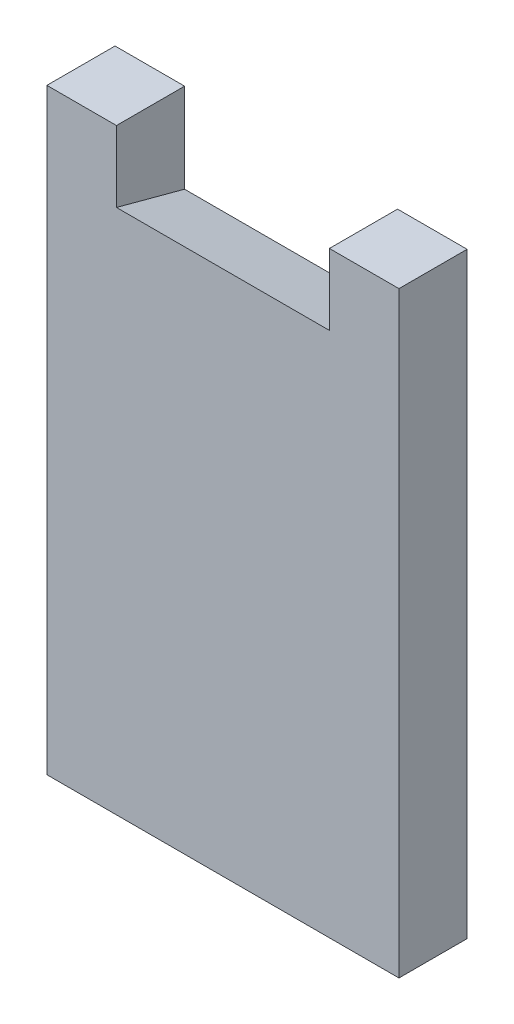
ISO-10303-21;
HEADER;
FILE_DESCRIPTION(('STEP AP214'),'2;1');
FILE_NAME('part.step','',(''),(''),'','','');
FILE_SCHEMA(('AUTOMOTIVE_DESIGN { 1 0 10303 214 1 1 1 1 }'));
ENDSEC;
DATA;
#1=APPLICATION_CONTEXT('core data for automotive mechanical design processes');
#2=APPLICATION_PROTOCOL_DEFINITION('international standard','automotive_design',2000,#1);
#3=PRODUCT_CONTEXT('',#1,'mechanical');
#4=PRODUCT('Part','Part','',(#3));
#5=PRODUCT_RELATED_PRODUCT_CATEGORY('part','',(#4));
#6=PRODUCT_DEFINITION_FORMATION('','',#4);
#7=PRODUCT_DEFINITION_CONTEXT('part definition',#1,'design');
#8=PRODUCT_DEFINITION('design','',#6,#7);
#9=PRODUCT_DEFINITION_SHAPE('','',#8);
#10=(LENGTH_UNIT() NAMED_UNIT(*) SI_UNIT(.MILLI.,.METRE.));
#11=(NAMED_UNIT(*) PLANE_ANGLE_UNIT() SI_UNIT($,.RADIAN.));
#12=(NAMED_UNIT(*) SI_UNIT($,.STERADIAN.) SOLID_ANGLE_UNIT());
#13=UNCERTAINTY_MEASURE_WITH_UNIT(LENGTH_MEASURE(1.E-05),#10,'distance_accuracy_value','');
#14=(GEOMETRIC_REPRESENTATION_CONTEXT(3) GLOBAL_UNCERTAINTY_ASSIGNED_CONTEXT((#13)) GLOBAL_UNIT_ASSIGNED_CONTEXT((#10,
#11,#12)) REPRESENTATION_CONTEXT('',''));
#15=CARTESIAN_POINT('',(0.,0.,0.));
#16=DIRECTION('',(0.,0.,1.));
#17=DIRECTION('',(1.,0.,0.));
#18=AXIS2_PLACEMENT_3D('',#15,#16,#17);
#19=CARTESIAN_POINT('',(0.,0.,9.6));
#20=DIRECTION('',(0.,1.,0.));
#21=DIRECTION('',(0.,0.,1.));
#22=AXIS2_PLACEMENT_3D('',#19,#20,#21);
#23=PLANE('',#22);
#24=DIRECTION('',(1.,0.,0.));
#25=VECTOR('',#24,1.);
#26=CARTESIAN_POINT('',(0.,0.,0.));
#27=LINE('',#26,#25);
#28=CARTESIAN_POINT('',(39.8,0.,0.));
#29=VERTEX_POINT('',#28);
#30=CARTESIAN_POINT('',(49.6,0.,0.));
#31=VERTEX_POINT('',#30);
#32=EDGE_CURVE('E116',#29,#31,#27,.T.);
#33=ORIENTED_EDGE('',*,*,#32,.F.);
#34=DIRECTION('',(0.,0.,-1.));
#35=VECTOR('',#34,1.);
#36=CARTESIAN_POINT('',(39.8,0.,9.6));
#37=LINE('',#36,#35);
#38=CARTESIAN_POINT('',(39.8,0.,9.6));
#39=VERTEX_POINT('',#38);
#40=EDGE_CURVE('E11',#39,#29,#37,.T.);
#41=ORIENTED_EDGE('',*,*,#40,.F.);
#42=DIRECTION('',(1.,0.,0.));
#43=VECTOR('',#42,1.);
#44=CARTESIAN_POINT('',(0.,0.,9.6));
#45=LINE('',#44,#43);
#46=CARTESIAN_POINT('',(49.6,0.,9.6));
#47=VERTEX_POINT('',#46);
#48=EDGE_CURVE('E126',#39,#47,#45,.T.);
#49=ORIENTED_EDGE('',*,*,#48,.T.);
#50=DIRECTION('',(0.,0.,-1.));
#51=VECTOR('',#50,1.);
#52=CARTESIAN_POINT('',(49.6,0.,9.6));
#53=LINE('',#52,#51);
#54=EDGE_CURVE('E57',#47,#31,#53,.T.);
#55=ORIENTED_EDGE('',*,*,#54,.T.);
#56=EDGE_LOOP('',(#33,#41,#49,#55));
#57=FACE_BOUND('',#56,.T.);
#58=ADVANCED_FACE('F38',(#57),#23,.T.);
#59=CARTESIAN_POINT('',(39.8,0.,9.6));
#60=DIRECTION('',(1.,0.,0.));
#61=DIRECTION('',(0.,0.,-1.));
#62=AXIS2_PLACEMENT_3D('',#59,#60,#61);
#63=PLANE('',#62);
#64=DIRECTION('',(0.,-1.,0.));
#65=VECTOR('',#64,1.);
#66=CARTESIAN_POINT('',(39.8,0.,0.));
#67=LINE('',#66,#65);
#68=CARTESIAN_POINT('',(39.8,-12.5723122473388,0.));
#69=VERTEX_POINT('',#68);
#70=EDGE_CURVE('E106',#29,#69,#67,.T.);
#71=ORIENTED_EDGE('',*,*,#70,.T.);
#72=DIRECTION('',(0.,-0.258819045102521,-0.965925826289068));
#73=VECTOR('',#72,1.);
#74=CARTESIAN_POINT('',(39.8,-9.99999999999999,9.6));
#75=LINE('',#74,#73);
#76=CARTESIAN_POINT('',(39.8,-9.99999999999999,9.6));
#77=VERTEX_POINT('',#76);
#78=EDGE_CURVE('E48',#77,#69,#75,.T.);
#79=ORIENTED_EDGE('',*,*,#78,.F.);
#80=DIRECTION('',(0.,-1.,0.));
#81=VECTOR('',#80,1.);
#82=CARTESIAN_POINT('',(39.8,0.,9.6));
#83=LINE('',#82,#81);
#84=EDGE_CURVE('E154',#39,#77,#83,.T.);
#85=ORIENTED_EDGE('',*,*,#84,.F.);
#86=ORIENTED_EDGE('',*,*,#40,.T.);
#87=EDGE_LOOP('',(#71,#79,#85,#86));
#88=FACE_BOUND('',#87,.T.);
#89=ADVANCED_FACE('F163',(#88),#63,.F.);
#90=CARTESIAN_POINT('',(0.,-10.,9.6));
#91=DIRECTION('',(0.,0.965925826289068,-0.258819045102521));
#92=DIRECTION('',(0.,0.258819045102521,0.965925826289068));
#93=AXIS2_PLACEMENT_3D('',#90,#91,#92);
#94=PLANE('',#93);
#95=DIRECTION('',(1.,0.,0.));
#96=VECTOR('',#95,1.);
#97=CARTESIAN_POINT('',(0.,-12.5723122473388,0.));
#98=LINE('',#97,#96);
#99=CARTESIAN_POINT('',(9.79999999999999,-12.5723122473388,0.));
#100=VERTEX_POINT('',#99);
#101=EDGE_CURVE('E103',#100,#69,#98,.T.);
#102=ORIENTED_EDGE('',*,*,#101,.F.);
#103=DIRECTION('',(0.,-0.258819045102521,-0.965925826289068));
#104=VECTOR('',#103,1.);
#105=CARTESIAN_POINT('',(9.79999999999999,-10.,9.6));
#106=LINE('',#105,#104);
#107=CARTESIAN_POINT('',(9.79999999999999,-10.,9.6));
#108=VERTEX_POINT('',#107);
#109=EDGE_CURVE('E42',#108,#100,#106,.T.);
#110=ORIENTED_EDGE('',*,*,#109,.F.);
#111=DIRECTION('',(1.,0.,0.));
#112=VECTOR('',#111,1.);
#113=CARTESIAN_POINT('',(0.,-10.,9.6));
#114=LINE('',#113,#112);
#115=EDGE_CURVE('E150',#108,#77,#114,.T.);
#116=ORIENTED_EDGE('',*,*,#115,.T.);
#117=ORIENTED_EDGE('',*,*,#78,.T.);
#118=EDGE_LOOP('',(#102,#110,#116,#117));
#119=FACE_BOUND('',#118,.T.);
#120=ADVANCED_FACE('F40',(#119),#94,.T.);
#121=CARTESIAN_POINT('',(9.8,0.,9.6));
#122=DIRECTION('',(1.,0.,0.));
#123=DIRECTION('',(0.,1.,0.));
#124=AXIS2_PLACEMENT_3D('',#121,#122,#123);
#125=PLANE('',#124);
#126=DIRECTION('',(0.,-1.,0.));
#127=VECTOR('',#126,1.);
#128=CARTESIAN_POINT('',(9.8,0.,0.));
#129=LINE('',#128,#127);
#130=CARTESIAN_POINT('',(9.8,0.,0.));
#131=VERTEX_POINT('',#130);
#132=EDGE_CURVE('E95',#131,#100,#129,.T.);
#133=ORIENTED_EDGE('',*,*,#132,.F.);
#134=DIRECTION('',(0.,0.,-1.));
#135=VECTOR('',#134,1.);
#136=CARTESIAN_POINT('',(9.8,0.,9.6));
#137=LINE('',#136,#135);
#138=CARTESIAN_POINT('',(9.8,0.,9.6));
#139=VERTEX_POINT('',#138);
#140=EDGE_CURVE('E101',#139,#131,#137,.T.);
#141=ORIENTED_EDGE('',*,*,#140,.F.);
#142=DIRECTION('',(0.,-1.,0.));
#143=VECTOR('',#142,1.);
#144=CARTESIAN_POINT('',(9.8,0.,9.6));
#145=LINE('',#144,#143);
#146=EDGE_CURVE('E99',#139,#108,#145,.T.);
#147=ORIENTED_EDGE('',*,*,#146,.T.);
#148=ORIENTED_EDGE('',*,*,#109,.T.);
#149=EDGE_LOOP('',(#133,#141,#147,#148));
#150=FACE_BOUND('',#149,.T.);
#151=ADVANCED_FACE('F92',(#150),#125,.T.);
#152=CARTESIAN_POINT('',(0.,0.,0.));
#153=VERTEX_POINT('',#152);
#154=EDGE_CURVE('E112',#153,#131,#27,.T.);
#155=ORIENTED_EDGE('',*,*,#154,.F.);
#156=DIRECTION('',(0.,0.,-1.));
#157=VECTOR('',#156,1.);
#158=CARTESIAN_POINT('',(0.,0.,9.6));
#159=LINE('',#158,#157);
#160=CARTESIAN_POINT('',(0.,0.,9.6));
#161=VERTEX_POINT('',#160);
#162=EDGE_CURVE('E134',#161,#153,#159,.T.);
#163=ORIENTED_EDGE('',*,*,#162,.F.);
#164=EDGE_CURVE('E142',#161,#139,#45,.T.);
#165=ORIENTED_EDGE('',*,*,#164,.T.);
#166=ORIENTED_EDGE('',*,*,#140,.T.);
#167=EDGE_LOOP('',(#155,#163,#165,#166));
#168=FACE_BOUND('',#167,.T.);
#169=ADVANCED_FACE('F138',(#168),#23,.T.);
#170=CARTESIAN_POINT('',(0.,0.,9.6));
#171=DIRECTION('',(1.,0.,0.));
#172=DIRECTION('',(0.,1.,0.));
#173=AXIS2_PLACEMENT_3D('',#170,#171,#172);
#174=PLANE('',#173);
#175=DIRECTION('',(0.,-1.,0.));
#176=VECTOR('',#175,1.);
#177=CARTESIAN_POINT('',(0.,0.,0.));
#178=LINE('',#177,#176);
#179=CARTESIAN_POINT('',(0.,-84.11,0.));
#180=VERTEX_POINT('',#179);
#181=EDGE_CURVE('E114',#153,#180,#178,.T.);
#182=ORIENTED_EDGE('',*,*,#181,.T.);
#183=DIRECTION('',(0.,0.,-1.));
#184=VECTOR('',#183,1.);
#185=CARTESIAN_POINT('',(0.,-84.11,9.6));
#186=LINE('',#185,#184);
#187=CARTESIAN_POINT('',(0.,-84.11,9.6));
#188=VERTEX_POINT('',#187);
#189=EDGE_CURVE('E131',#188,#180,#186,.T.);
#190=ORIENTED_EDGE('',*,*,#189,.F.);
#191=DIRECTION('',(0.,-1.,0.));
#192=VECTOR('',#191,1.);
#193=CARTESIAN_POINT('',(0.,0.,9.6));
#194=LINE('',#193,#192);
#195=EDGE_CURVE('E152',#161,#188,#194,.T.);
#196=ORIENTED_EDGE('',*,*,#195,.F.);
#197=ORIENTED_EDGE('',*,*,#162,.T.);
#198=EDGE_LOOP('',(#182,#190,#196,#197));
#199=FACE_BOUND('',#198,.T.);
#200=ADVANCED_FACE('F177',(#199),#174,.F.);
#201=CARTESIAN_POINT('',(0.,-84.11,9.6));
#202=DIRECTION('',(0.,1.,0.));
#203=DIRECTION('',(-1.,0.,0.));
#204=AXIS2_PLACEMENT_3D('',#201,#202,#203);
#205=PLANE('',#204);
#206=DIRECTION('',(1.,0.,0.));
#207=VECTOR('',#206,1.);
#208=CARTESIAN_POINT('',(0.,-84.11,0.));
#209=LINE('',#208,#207);
#210=CARTESIAN_POINT('',(49.6,-84.11,0.));
#211=VERTEX_POINT('',#210);
#212=EDGE_CURVE('E120',#180,#211,#209,.T.);
#213=ORIENTED_EDGE('',*,*,#212,.T.);
#214=DIRECTION('',(0.,0.,-1.));
#215=VECTOR('',#214,1.);
#216=CARTESIAN_POINT('',(49.6,-84.11,9.6));
#217=LINE('',#216,#215);
#218=CARTESIAN_POINT('',(49.6,-84.11,9.6));
#219=VERTEX_POINT('',#218);
#220=EDGE_CURVE('E128',#219,#211,#217,.T.);
#221=ORIENTED_EDGE('',*,*,#220,.F.);
#222=DIRECTION('',(1.,0.,0.));
#223=VECTOR('',#222,1.);
#224=CARTESIAN_POINT('',(0.,-84.11,9.6));
#225=LINE('',#224,#223);
#226=EDGE_CURVE('E159',#188,#219,#225,.T.);
#227=ORIENTED_EDGE('',*,*,#226,.F.);
#228=ORIENTED_EDGE('',*,*,#189,.T.);
#229=EDGE_LOOP('',(#213,#221,#227,#228));
#230=FACE_BOUND('',#229,.T.);
#231=ADVANCED_FACE('F174',(#230),#205,.F.);
#232=CARTESIAN_POINT('',(49.6,0.,9.6));
#233=DIRECTION('',(1.,0.,0.));
#234=DIRECTION('',(0.,1.,0.));
#235=AXIS2_PLACEMENT_3D('',#232,#233,#234);
#236=PLANE('',#235);
#237=DIRECTION('',(0.,-1.,0.));
#238=VECTOR('',#237,1.);
#239=CARTESIAN_POINT('',(49.6,0.,0.));
#240=LINE('',#239,#238);
#241=EDGE_CURVE('E123',#31,#211,#240,.T.);
#242=ORIENTED_EDGE('',*,*,#241,.F.);
#243=ORIENTED_EDGE('',*,*,#54,.F.);
#244=DIRECTION('',(0.,-1.,0.));
#245=VECTOR('',#244,1.);
#246=CARTESIAN_POINT('',(49.6,0.,9.6));
#247=LINE('',#246,#245);
#248=EDGE_CURVE('E129',#47,#219,#247,.T.);
#249=ORIENTED_EDGE('',*,*,#248,.T.);
#250=ORIENTED_EDGE('',*,*,#220,.T.);
#251=EDGE_LOOP('',(#242,#243,#249,#250));
#252=FACE_BOUND('',#251,.T.);
#253=ADVANCED_FACE('F171',(#252),#236,.T.);
#254=CARTESIAN_POINT('',(0.,0.,9.6));
#255=DIRECTION('',(0.,0.,1.));
#256=DIRECTION('',(1.,0.,0.));
#257=AXIS2_PLACEMENT_3D('',#254,#255,#256);
#258=PLANE('',#257);
#259=ORIENTED_EDGE('',*,*,#48,.F.);
#260=ORIENTED_EDGE('',*,*,#84,.T.);
#261=ORIENTED_EDGE('',*,*,#115,.F.);
#262=ORIENTED_EDGE('',*,*,#146,.F.);
#263=ORIENTED_EDGE('',*,*,#164,.F.);
#264=ORIENTED_EDGE('',*,*,#195,.T.);
#265=ORIENTED_EDGE('',*,*,#226,.T.);
#266=ORIENTED_EDGE('',*,*,#248,.F.);
#267=EDGE_LOOP('',(#259,#260,#261,#262,#263,#264,#265,#266));
#268=FACE_BOUND('',#267,.T.);
#269=ADVANCED_FACE('F147',(#268),#258,.T.);
#270=CARTESIAN_POINT('',(0.,0.,0.));
#271=DIRECTION('',(0.,0.,1.));
#272=DIRECTION('',(1.,0.,0.));
#273=AXIS2_PLACEMENT_3D('',#270,#271,#272);
#274=PLANE('',#273);
#275=ORIENTED_EDGE('',*,*,#32,.T.);
#276=ORIENTED_EDGE('',*,*,#241,.T.);
#277=ORIENTED_EDGE('',*,*,#212,.F.);
#278=ORIENTED_EDGE('',*,*,#181,.F.);
#279=ORIENTED_EDGE('',*,*,#154,.T.);
#280=ORIENTED_EDGE('',*,*,#132,.T.);
#281=ORIENTED_EDGE('',*,*,#101,.T.);
#282=ORIENTED_EDGE('',*,*,#70,.F.);
#283=EDGE_LOOP('',(#275,#276,#277,#278,#279,#280,#281,#282));
#284=FACE_BOUND('',#283,.T.);
#285=ADVANCED_FACE('F109',(#284),#274,.F.);
#286=CLOSED_SHELL('',(#58,#89,#120,#151,#169,#200,#231,#253,#269,#285));
#287=MANIFOLD_SOLID_BREP('B2',#286);
#288=ADVANCED_BREP_SHAPE_REPRESENTATION('',(#18,#287),#14);
#289=SHAPE_DEFINITION_REPRESENTATION(#9,#288);
ENDSEC;
END-ISO-10303-21;
